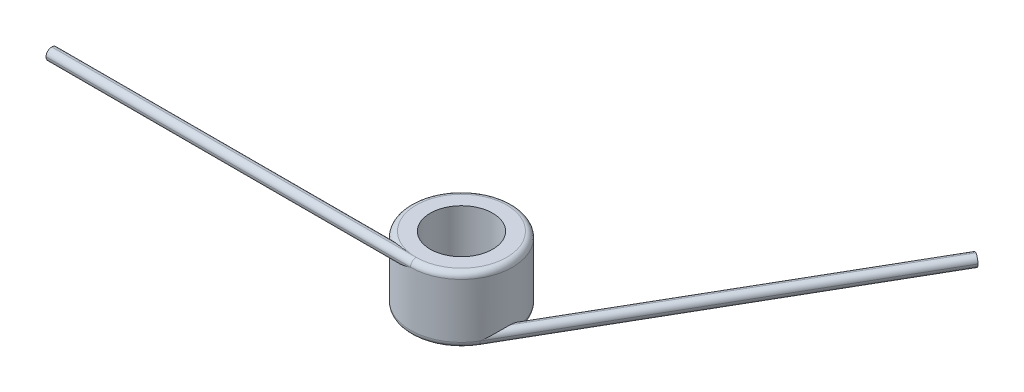
ISO-10303-21;
HEADER;
FILE_DESCRIPTION(('STEP AP214'),'2;1');
FILE_NAME('part.step','',(''),(''),'','','');
FILE_SCHEMA(('AUTOMOTIVE_DESIGN { 1 0 10303 214 1 1 1 1 }'));
ENDSEC;
DATA;
#1=APPLICATION_CONTEXT('core data for automotive mechanical design processes');
#2=APPLICATION_PROTOCOL_DEFINITION('international standard','automotive_design',2000,#1);
#3=PRODUCT_CONTEXT('',#1,'mechanical');
#4=PRODUCT('Part','Part','',(#3));
#5=PRODUCT_RELATED_PRODUCT_CATEGORY('part','',(#4));
#6=PRODUCT_DEFINITION_FORMATION('','',#4);
#7=PRODUCT_DEFINITION_CONTEXT('part definition',#1,'design');
#8=PRODUCT_DEFINITION('design','',#6,#7);
#9=PRODUCT_DEFINITION_SHAPE('','',#8);
#10=(LENGTH_UNIT() NAMED_UNIT(*) SI_UNIT(.MILLI.,.METRE.));
#11=(NAMED_UNIT(*) PLANE_ANGLE_UNIT() SI_UNIT($,.RADIAN.));
#12=(NAMED_UNIT(*) SI_UNIT($,.STERADIAN.) SOLID_ANGLE_UNIT());
#13=UNCERTAINTY_MEASURE_WITH_UNIT(LENGTH_MEASURE(1.E-05),#10,'distance_accuracy_value','');
#14=(GEOMETRIC_REPRESENTATION_CONTEXT(3) GLOBAL_UNCERTAINTY_ASSIGNED_CONTEXT((#13)) GLOBAL_UNIT_ASSIGNED_CONTEXT((#10,
#11,#12)) REPRESENTATION_CONTEXT('',''));
#15=CARTESIAN_POINT('',(0.,0.,0.));
#16=DIRECTION('',(0.,0.,1.));
#17=DIRECTION('',(1.,0.,0.));
#18=AXIS2_PLACEMENT_3D('',#15,#16,#17);
#19=CARTESIAN_POINT('',(0.,9.1948,0.));
#20=DIRECTION('',(0.,-1.,0.));
#21=DIRECTION('',(0.,0.,-1.));
#22=AXIS2_PLACEMENT_3D('',#19,#20,#21);
#23=CYLINDRICAL_SURFACE('',#22,7.112);
#24=CARTESIAN_POINT('',(-3.27726446750945,7.5946,6.3119));
#25=CARTESIAN_POINT('',(-3.22577319071094,7.59460874121384,6.33863640810558));
#26=CARTESIAN_POINT('',(-3.17397080121037,7.59593894352443,6.3647320916057));
#27=CARTESIAN_POINT('',(-3.06985554330409,7.60093516358517,6.41559687844702));
#28=CARTESIAN_POINT('',(-3.01754290426367,7.60460017550516,6.44036654805308));
#29=CARTESIAN_POINT('',(-2.86016865994779,7.61861872182236,6.51254780297371));
#30=CARTESIAN_POINT('',(-2.75444607475934,7.63199848772709,6.55794815943722));
#31=CARTESIAN_POINT('',(-2.54227229890444,7.66493502375927,6.64307265846747));
#32=CARTESIAN_POINT('',(-2.43582617169205,7.6844650790488,6.68282029059783));
#33=CARTESIAN_POINT('',(-2.22200236123469,7.72839217607958,6.7569270793068));
#34=CARTESIAN_POINT('',(-2.11462408422714,7.75279257703432,6.79128248733932));
#35=CARTESIAN_POINT('',(-1.84276867346074,7.81917071884919,6.87124565452523));
#36=CARTESIAN_POINT('',(-1.67785384252937,7.86365942235866,6.9133170976154));
#37=CARTESIAN_POINT('',(-1.34713711270919,7.9585399994525,6.98530174523664));
#38=CARTESIAN_POINT('',(-1.18133498224518,8.00893349380589,7.0152116014921));
#39=CARTESIAN_POINT('',(-0.682899888290272,8.1656694348529,7.08709086236258));
#40=CARTESIAN_POINT('',(-0.349157968962766,8.27758917674851,7.11123322508794));
#41=CARTESIAN_POINT('',(-0.0106605278621279,8.39112437230441,7.11199400277877));
#42=CARTESIAN_POINT('',(-0.00533018613452246,8.39291222380704,7.1119999947834));
#43=CARTESIAN_POINT('',(0.,8.3947,7.112));
#44=B_SPLINE_CURVE_WITH_KNOTS('',3,(#24,#25,#26,#27,#28,#29,#30,#31,#32,#33,#34,#35,#36,#37,#38,
#39,#40,#41,#42,#43),.UNSPECIFIED.,.F.,.F.,(4,2,2,2,2,2,2,2,2,4),(0.,0.174006957486812,
0.347939003854595,0.695046557647343,1.04066671662636,1.38652608839392,1.91360707300454,
2.4408330731805,3.49502816093425,3.51189470542901),.UNSPECIFIED.);
#45=CARTESIAN_POINT('',(0.,8.3947,7.112));
#46=VERTEX_POINT('',#45);
#47=CARTESIAN_POINT('',(-3.27726446750945,7.5946,6.3119));
#48=VERTEX_POINT('',#47);
#49=EDGE_CURVE('E194',#46,#48,#44,.F.);
#50=ORIENTED_EDGE('',*,*,#49,.T.);
#51=CARTESIAN_POINT('',(-3.27726446750944,7.5946,6.3119));
#52=CARTESIAN_POINT('',(-3.33684636501458,7.59462950665445,6.28097233450951));
#53=CARTESIAN_POINT('',(-3.39603078899823,7.59639786892391,6.24916342132021));
#54=CARTESIAN_POINT('',(-3.51355143645542,7.60421608549922,6.1838510683771));
#55=CARTESIAN_POINT('',(-3.57188188450809,7.61028746507999,6.15033989895407));
#56=CARTESIAN_POINT('',(-3.68766233258712,7.62762527577035,6.08163436560927));
#57=CARTESIAN_POINT('',(-3.74509577354935,7.63894768670843,6.04642562220361));
#58=CARTESIAN_POINT('',(-3.85771272353521,7.66787824241751,5.9751998519368));
#59=CARTESIAN_POINT('',(-3.91290116558248,7.68547167202177,5.93918490073875));
#60=CARTESIAN_POINT('',(-4.00525249208175,7.72235362104469,5.87713169880061));
#61=CARTESIAN_POINT('',(-4.04315445374767,7.73980501922617,5.8511087348269));
#62=CARTESIAN_POINT('',(-4.11678717653781,7.77931573574368,5.79953625179383));
#63=CARTESIAN_POINT('',(-4.15252050554959,7.80136946138225,5.77398619871112));
#64=CARTESIAN_POINT('',(-4.22138970936993,7.85101548010348,5.72383115259485));
#65=CARTESIAN_POINT('',(-4.25449880463334,7.87865663809345,5.69923695516696));
#66=CARTESIAN_POINT('',(-4.31651957433505,7.94004310018073,5.65240697734943));
#67=CARTESIAN_POINT('',(-4.34543791946912,7.97377850696718,5.63016746439981));
#68=CARTESIAN_POINT('',(-4.38939727605734,8.03639686071476,5.59591490763217));
#69=CARTESIAN_POINT('',(-4.40597974002244,8.06361737683548,5.58285251332363));
#70=CARTESIAN_POINT('',(-4.43551677737668,8.12105110708317,5.55941455104074));
#71=CARTESIAN_POINT('',(-4.44847432845384,8.15126183711166,5.54903677831234));
#72=CARTESIAN_POINT('',(-4.46851837696362,8.20996768551786,5.53290439682252));
#73=CARTESIAN_POINT('',(-4.47615757469814,8.2381538166173,5.52671766818688));
#74=CARTESIAN_POINT('',(-4.48762439734803,8.29574649734046,5.51741148642021));
#75=CARTESIAN_POINT('',(-4.49146083255316,8.32515006082171,5.51428494362298));
#76=CARTESIAN_POINT('',(-4.4941023454781,8.36803319163165,5.51213071648264));
#77=CARTESIAN_POINT('',(-4.49451449298493,8.38136938047673,5.51179415880985));
#78=CARTESIAN_POINT('',(-4.49450828901227,8.3947,5.5118));
#79=B_SPLINE_CURVE_WITH_KNOTS('',3,(#51,#52,#53,#54,#55,#56,#57,#58,#59,#60,#61,#62,#63,#64,#65,
#66,#67,#68,#69,#70,#71,#72,#73,#74,#75,#76,#77,#78),.UNSPECIFIED.,.F.,.F.,(4,2,2,2,2,2,2,2,2,2,
2,2,2,4),(0.,0.20144452556642,0.403903928729936,0.608573143021147,0.81276522170529,
0.960081764455189,1.10722032145835,1.25570615356907,1.40395297175356,1.50694498887674,
1.60985215301296,1.69902772272233,1.78799620300548,1.82799412834761),.UNSPECIFIED.);
#80=CARTESIAN_POINT('',(-4.49450828901227,8.3947,5.5118));
#81=VERTEX_POINT('',#80);
#82=EDGE_CURVE('E202',#48,#81,#79,.T.);
#83=ORIENTED_EDGE('',*,*,#82,.T.);
#84=CARTESIAN_POINT('',(0.,8.3947,0.));
#85=DIRECTION('',(0.,1.,0.));
#86=DIRECTION('',(0.,0.,1.));
#87=AXIS2_PLACEMENT_3D('',#84,#85,#86);
#88=CIRCLE('',#87,7.112);
#89=EDGE_CURVE('E248',#81,#46,#88,.F.);
#90=ORIENTED_EDGE('',*,*,#89,.T.);
#91=EDGE_LOOP('',(#50,#83,#90));
#92=FACE_BOUND('',#91,.T.);
#93=CARTESIAN_POINT('',(0.,0.8001,0.));
#94=DIRECTION('',(0.,1.,0.));
#95=DIRECTION('',(0.,0.,1.));
#96=AXIS2_PLACEMENT_3D('',#93,#94,#95);
#97=CIRCLE('',#96,7.112);
#98=CARTESIAN_POINT('',(7.0206129650852,0.8001,-1.13645835580435));
#99=VERTEX_POINT('',#98);
#100=CARTESIAN_POINT('',(6.15917267171494,0.8001,3.55599999999999));
#101=VERTEX_POINT('',#100);
#102=EDGE_CURVE('E247',#99,#101,#97,.T.);
#103=ORIENTED_EDGE('',*,*,#102,.T.);
#104=CARTESIAN_POINT('',(7.10489797990172,1.6002,0.317755716216726));
#105=CARTESIAN_POINT('',(7.10230675012785,1.60019125878616,0.375716674050284));
#106=CARTESIAN_POINT('',(7.09900508021779,1.59886105647557,0.433626701084529));
#107=CARTESIAN_POINT('',(7.09099764882732,1.59386483641483,0.54922555277352));
#108=CARTESIAN_POINT('',(7.08629249242931,1.59019982449485,0.606914461924518));
#109=CARTESIAN_POINT('',(7.0701161707097,1.57618127817767,0.779295182863658));
#110=CARTESIAN_POINT('',(7.05657274015375,1.56280151227295,0.893553805622314));
#111=CARTESIAN_POINT('',(7.02420583087093,1.52986497624079,1.11986393504467));
#112=CARTESIAN_POINT('',(7.0054052264299,1.51033492095126,1.23192280141033));
#113=CARTESIAN_POINT('',(6.96267168281605,1.46640782392045,1.45415304755502));
#114=CARTESIAN_POINT('',(6.93873520042581,1.44200742296568,1.56432306727448));
#115=CARTESIAN_POINT('',(6.87205762919264,1.37562928115084,1.83973834274748));
#116=CARTESIAN_POINT('',(6.8260351522169,1.33114057764146,2.00359449733998));
#117=CARTESIAN_POINT('',(6.7230173208293,1.23626000054736,2.32599591063136));
#118=CARTESIAN_POINT('',(6.66601895093812,1.1858665061936,2.48453969574243));
#119=CARTESIAN_POINT('',(6.4790506698795,1.02913056514805,2.95213677968071));
#120=CARTESIAN_POINT('',(6.33308760964255,0.917210823256804,3.25323694149));
#121=CARTESIAN_POINT('',(6.16449774190003,0.803675627695759,3.54676471344307));
#122=CARTESIAN_POINT('',(6.16183776026448,0.801887776193045,3.55138392079232));
#123=CARTESIAN_POINT('',(6.15917267171494,0.8001,3.55599999999999));
#124=B_SPLINE_CURVE_WITH_KNOTS('',3,(#104,#105,#106,#107,#108,#109,#110,#111,#112,#113,#114,
#115,#116,#117,#118,#119,#120,#121,#122,#123),.UNSPECIFIED.,.F.,.F.,(4,2,2,2,2,2,2,2,2,4),(0.,
0.174006957486689,0.347939003854349,0.695046557646906,1.04066671662616,1.38652608839393,
1.91360707300458,2.44083307318063,3.49502816093425,3.51189470542901),.UNSPECIFIED.);
#125=CARTESIAN_POINT('',(7.10489797990172,1.6002,0.317755716216754));
#126=VERTEX_POINT('',#125);
#127=EDGE_CURVE('E11',#101,#126,#124,.F.);
#128=ORIENTED_EDGE('',*,*,#127,.T.);
#129=CARTESIAN_POINT('',(7.10489797990172,1.6002,0.317755716216754));
#130=CARTESIAN_POINT('',(7.10790478465977,1.60017049334555,0.250692446626381));
#131=CARTESIAN_POINT('',(7.10994966976289,1.59840213107609,0.183532775353541));
#132=CARTESIAN_POINT('',(7.11214783666182,1.59058391450078,0.0491007327148604));
#133=CARTESIAN_POINT('',(7.11229153665729,1.58451253492001,-0.0181705018243961));
#134=CARTESIAN_POINT('',(7.11068102343965,1.56717472422965,-0.152792077794776));
#135=CARTESIAN_POINT('',(7.10890607769613,1.55585231329157,-0.220135268397657));
#136=CARTESIAN_POINT('',(7.1035312262339,1.52692175758249,-0.353277293115536));
#137=CARTESIAN_POINT('',(7.09993558460395,1.50932832797823,-0.419079361522783));
#138=CARTESIAN_POINT('',(7.09237159858899,1.47244637895531,-0.530084557313414));
#139=CARTESIAN_POINT('',(7.08878603153896,1.45499498077383,-0.575920100956219));
#140=CARTESIAN_POINT('',(7.08093931249115,1.41548426425633,-0.665474150958833));
#141=CARTESIAN_POINT('',(7.07667898195937,1.39343053861776,-0.709195148186177));
#142=CARTESIAN_POINT('',(7.06767803980487,1.34378451989653,-0.793915151291135));
#143=CARTESIAN_POINT('',(7.06293338767833,1.31614336190656,-0.834885567599511));
#144=CARTESIAN_POINT('',(7.05338782208054,1.25475689981928,-0.912012118632224));
#145=CARTESIAN_POINT('',(7.04858701146541,1.22102149303283,-0.948175896628547));
#146=CARTESIAN_POINT('',(7.04090310545418,1.15840313928525,-1.00337209455178));
#147=CARTESIAN_POINT('',(7.03788197213129,1.13118262316452,-1.02426412675717));
#148=CARTESIAN_POINT('',(7.03235262005848,1.07374889291683,-1.06156293259992));
#149=CARTESIAN_POINT('',(7.02984398077957,1.04353816288834,-1.07797338736777));
#150=CARTESIAN_POINT('',(7.02589495284072,0.984832314482139,-1.10339823331684));
#151=CARTESIAN_POINT('',(7.0243566875432,0.956646183382703,-1.11310733693729));
#152=CARTESIAN_POINT('',(7.02203070904598,0.89905350265954,-1.12769098753611));
#153=CARTESIAN_POINT('',(7.02124126116012,0.869649939178285,-1.13257670928235));
#154=CARTESIAN_POINT('',(7.02069640219354,0.826766808368349,-1.13594144014994));
#155=CARTESIAN_POINT('',(7.02061100845247,0.813430619523269,-1.13646664919736));
#156=CARTESIAN_POINT('',(7.02061296508521,0.8001,-1.13645835580435));
#157=B_SPLINE_CURVE_WITH_KNOTS('',3,(#129,#130,#131,#132,#133,#134,#135,#136,#137,#138,#139,
#140,#141,#142,#143,#144,#145,#146,#147,#148,#149,#150,#151,#152,#153,#154,#155,#156),
.UNSPECIFIED.,.F.,.F.,(4,2,2,2,2,2,2,2,2,2,2,2,2,4),(0.,0.20144452556642,0.403903928729936,
0.608573143021147,0.81276522170529,0.960081764455191,1.10722032145835,1.25570615356907,
1.40395297175357,1.50694498887675,1.60985215301298,1.69902772272234,1.78799620300549,
1.82799412834762),.UNSPECIFIED.);
#158=EDGE_CURVE('E44',#126,#99,#157,.T.);
#159=ORIENTED_EDGE('',*,*,#158,.T.);
#160=EDGE_LOOP('',(#103,#128,#159));
#161=FACE_BOUND('',#160,.T.);
#162=ADVANCED_FACE('F34',(#92,#161),#23,.T.);
#163=CARTESIAN_POINT('',(0.,9.1948,0.));
#164=DIRECTION('',(0.,1.,0.));
#165=DIRECTION('',(0.,0.,1.));
#166=AXIS2_PLACEMENT_3D('',#163,#164,#165);
#167=PLANE('',#166);
#168=CARTESIAN_POINT('',(0.,9.1948,0.));
#169=DIRECTION('',(0.,1.,0.));
#170=DIRECTION('',(0.,0.,1.));
#171=AXIS2_PLACEMENT_3D('',#168,#169,#170);
#172=CIRCLE('',#171,6.3119);
#173=CARTESIAN_POINT('',(0.,9.1948,6.3119));
#174=VERTEX_POINT('',#173);
#175=EDGE_CURVE('E233',#174,#174,#172,.T.);
#176=ORIENTED_EDGE('',*,*,#175,.T.);
#177=EDGE_LOOP('',(#176));
#178=FACE_BOUND('',#177,.T.);
#179=CARTESIAN_POINT('',(0.,9.1948,0.));
#180=DIRECTION('',(0.,1.,0.));
#181=DIRECTION('',(0.,0.,1.));
#182=AXIS2_PLACEMENT_3D('',#179,#180,#181);
#183=CIRCLE('',#182,4.3561);
#184=CARTESIAN_POINT('',(0.,9.1948,4.3561));
#185=VERTEX_POINT('',#184);
#186=EDGE_CURVE('E270',#185,#185,#183,.T.);
#187=ORIENTED_EDGE('',*,*,#186,.F.);
#188=EDGE_LOOP('',(#187));
#189=FACE_BOUND('',#188,.T.);
#190=ADVANCED_FACE('F186',(#178,#189),#167,.T.);
#191=CARTESIAN_POINT('',(0.,0.,0.));
#192=DIRECTION('',(0.,1.,0.));
#193=DIRECTION('',(0.,0.,1.));
#194=AXIS2_PLACEMENT_3D('',#191,#192,#193);
#195=PLANE('',#194);
#196=CARTESIAN_POINT('',(0.,0.,0.));
#197=DIRECTION('',(0.,1.,0.));
#198=DIRECTION('',(0.,0.,1.));
#199=AXIS2_PLACEMENT_3D('',#196,#197,#198);
#200=CIRCLE('',#199,6.3119);
#201=CARTESIAN_POINT('',(5.466265746147,0.,3.15594999999999));
#202=VERTEX_POINT('',#201);
#203=EDGE_CURVE('E278',#202,#202,#200,.F.);
#204=ORIENTED_EDGE('',*,*,#203,.T.);
#205=EDGE_LOOP('',(#204));
#206=FACE_BOUND('',#205,.T.);
#207=CARTESIAN_POINT('',(0.,0.,0.));
#208=DIRECTION('',(0.,1.,0.));
#209=DIRECTION('',(0.,0.,1.));
#210=AXIS2_PLACEMENT_3D('',#207,#208,#209);
#211=CIRCLE('',#210,4.3561);
#212=CARTESIAN_POINT('',(0.,0.,4.3561));
#213=VERTEX_POINT('',#212);
#214=EDGE_CURVE('E271',#213,#213,#211,.T.);
#215=ORIENTED_EDGE('',*,*,#214,.T.);
#216=EDGE_LOOP('',(#215));
#217=FACE_BOUND('',#216,.T.);
#218=ADVANCED_FACE('F188',(#206,#217),#195,.F.);
#219=CARTESIAN_POINT('',(0.,9.1948,0.));
#220=DIRECTION('',(0.,-1.,0.));
#221=DIRECTION('',(0.,0.,-1.));
#222=AXIS2_PLACEMENT_3D('',#219,#220,#221);
#223=CYLINDRICAL_SURFACE('',#222,4.3561);
#224=ORIENTED_EDGE('',*,*,#186,.T.);
#225=EDGE_LOOP('',(#224));
#226=FACE_BOUND('',#225,.T.);
#227=ORIENTED_EDGE('',*,*,#214,.F.);
#228=EDGE_LOOP('',(#227));
#229=FACE_BOUND('',#228,.T.);
#230=ADVANCED_FACE('F255',(#226,#229),#223,.F.);
#231=CARTESIAN_POINT('',(-50.8,7.5946,7.11200000000001));
#232=DIRECTION('',(-1.,0.,0.));
#233=DIRECTION('',(0.,0.,1.));
#234=AXIS2_PLACEMENT_3D('',#231,#232,#233);
#235=PLANE('',#234);
#236=CARTESIAN_POINT('',(-50.8,8.3947,6.31190000000001));
#237=DIRECTION('',(-1.,0.,0.));
#238=DIRECTION('',(0.,0.,1.));
#239=AXIS2_PLACEMENT_3D('',#236,#237,#238);
#240=CIRCLE('',#239,0.8001);
#241=CARTESIAN_POINT('',(-50.8,7.5946,6.31190000000001));
#242=VERTEX_POINT('',#241);
#243=CARTESIAN_POINT('',(-50.8,8.3947,7.11200000000001));
#244=VERTEX_POINT('',#243);
#245=EDGE_CURVE('E123',#242,#244,#240,.T.);
#246=ORIENTED_EDGE('',*,*,#245,.T.);
#247=CARTESIAN_POINT('',(-50.8,8.3947,6.31190000000001));
#248=DIRECTION('',(-1.,0.,0.));
#249=DIRECTION('',(0.,0.,1.));
#250=AXIS2_PLACEMENT_3D('',#247,#248,#249);
#251=CIRCLE('',#250,0.8001);
#252=CARTESIAN_POINT('',(-50.8,9.1948,6.31190000000001));
#253=VERTEX_POINT('',#252);
#254=EDGE_CURVE('E108',#244,#253,#251,.T.);
#255=ORIENTED_EDGE('',*,*,#254,.T.);
#256=CARTESIAN_POINT('',(-50.8,8.3947,6.31190000000001));
#257=DIRECTION('',(-1.,0.,0.));
#258=DIRECTION('',(0.,0.,1.));
#259=AXIS2_PLACEMENT_3D('',#256,#257,#258);
#260=CIRCLE('',#259,0.8001);
#261=CARTESIAN_POINT('',(-50.8,8.3947,5.51180000000001));
#262=VERTEX_POINT('',#261);
#263=EDGE_CURVE('E117',#253,#262,#260,.T.);
#264=ORIENTED_EDGE('',*,*,#263,.T.);
#265=CARTESIAN_POINT('',(-50.8,8.3947,6.31190000000001));
#266=DIRECTION('',(-1.,0.,0.));
#267=DIRECTION('',(0.,0.,1.));
#268=AXIS2_PLACEMENT_3D('',#265,#266,#267);
#269=CIRCLE('',#268,0.8001);
#270=EDGE_CURVE('E124',#262,#242,#269,.T.);
#271=ORIENTED_EDGE('',*,*,#270,.T.);
#272=EDGE_LOOP('',(#246,#255,#264,#271));
#273=FACE_BOUND('',#272,.T.);
#274=ADVANCED_FACE('F126',(#273),#235,.T.);
#275=CARTESIAN_POINT('',(31.5591726717149,1.6002,-40.4380905122495));
#276=DIRECTION('',(0.499999999999999,0.,-0.866025403784439));
#277=DIRECTION('',(-0.866025403784439,0.,-0.499999999999999));
#278=AXIS2_PLACEMENT_3D('',#275,#276,#277);
#279=PLANE('',#278);
#280=CARTESIAN_POINT('',(30.8662657461469,0.8001,-40.8381405122495));
#281=DIRECTION('',(0.499999999999999,0.,-0.866025403784439));
#282=DIRECTION('',(-0.866025403784439,0.,-0.499999999999999));
#283=AXIS2_PLACEMENT_3D('',#280,#281,#282);
#284=CIRCLE('',#283,0.8001);
#285=CARTESIAN_POINT('',(30.173358820579,0.8001,-41.2381905122495));
#286=VERTEX_POINT('',#285);
#287=CARTESIAN_POINT('',(30.8662657461469,1.6002,-40.8381405122495));
#288=VERTEX_POINT('',#287);
#289=EDGE_CURVE('E130',#286,#288,#284,.T.);
#290=ORIENTED_EDGE('',*,*,#289,.T.);
#291=CARTESIAN_POINT('',(30.8662657461469,0.8001,-40.8381405122495));
#292=DIRECTION('',(0.499999999999999,0.,-0.866025403784439));
#293=DIRECTION('',(-0.866025403784439,0.,-0.499999999999999));
#294=AXIS2_PLACEMENT_3D('',#291,#292,#293);
#295=CIRCLE('',#294,0.8001);
#296=CARTESIAN_POINT('',(31.5591726717149,0.8001,-40.4380905122495));
#297=VERTEX_POINT('',#296);
#298=EDGE_CURVE('E231',#288,#297,#295,.T.);
#299=ORIENTED_EDGE('',*,*,#298,.T.);
#300=CARTESIAN_POINT('',(30.8662657461469,0.8001,-40.8381405122495));
#301=DIRECTION('',(0.499999999999999,0.,-0.866025403784439));
#302=DIRECTION('',(-0.866025403784439,0.,-0.499999999999999));
#303=AXIS2_PLACEMENT_3D('',#300,#301,#302);
#304=CIRCLE('',#303,0.8001);
#305=CARTESIAN_POINT('',(30.8662657461469,0.,-40.8381405122495));
#306=VERTEX_POINT('',#305);
#307=EDGE_CURVE('E225',#297,#306,#304,.T.);
#308=ORIENTED_EDGE('',*,*,#307,.T.);
#309=CARTESIAN_POINT('',(30.8662657461469,0.8001,-40.8381405122495));
#310=DIRECTION('',(0.499999999999999,0.,-0.866025403784439));
#311=DIRECTION('',(-0.866025403784439,0.,-0.499999999999999));
#312=AXIS2_PLACEMENT_3D('',#309,#310,#311);
#313=CIRCLE('',#312,0.8001);
#314=EDGE_CURVE('E128',#306,#286,#313,.T.);
#315=ORIENTED_EDGE('',*,*,#314,.T.);
#316=EDGE_LOOP('',(#290,#299,#308,#315));
#317=FACE_BOUND('',#316,.T.);
#318=ADVANCED_FACE('F212',(#317),#279,.T.);
#319=CARTESIAN_POINT('',(-50.8,8.3947,6.31190000000001));
#320=DIRECTION('',(1.,0.,0.));
#321=DIRECTION('',(0.,0.,-1.));
#322=AXIS2_PLACEMENT_3D('',#319,#320,#321);
#323=CYLINDRICAL_SURFACE('',#322,0.8001);
#324=DIRECTION('',(-1.,0.,0.));
#325=VECTOR('',#324,1.);
#326=CARTESIAN_POINT('',(-50.8,8.3947,5.51180000000001));
#327=LINE('',#326,#325);
#328=EDGE_CURVE('E120',#81,#262,#327,.T.);
#329=ORIENTED_EDGE('',*,*,#328,.F.);
#330=ORIENTED_EDGE('',*,*,#82,.F.);
#331=DIRECTION('',(-1.,0.,0.));
#332=VECTOR('',#331,1.);
#333=CARTESIAN_POINT('',(-4.49450828901227,7.5946,6.3119));
#334=LINE('',#333,#332);
#335=EDGE_CURVE('E58',#242,#48,#334,.F.);
#336=ORIENTED_EDGE('',*,*,#335,.F.);
#337=ORIENTED_EDGE('',*,*,#270,.F.);
#338=EDGE_LOOP('',(#329,#330,#336,#337));
#339=FACE_BOUND('',#338,.T.);
#340=ADVANCED_FACE('F208',(#339),#323,.T.);
#341=CARTESIAN_POINT('',(0.,8.3947,6.3119));
#342=DIRECTION('',(-1.,0.,0.));
#343=DIRECTION('',(0.,0.,1.));
#344=AXIS2_PLACEMENT_3D('',#341,#342,#343);
#345=CYLINDRICAL_SURFACE('',#344,0.8001);
#346=ORIENTED_EDGE('',*,*,#335,.T.);
#347=ORIENTED_EDGE('',*,*,#49,.F.);
#348=DIRECTION('',(1.,0.,0.));
#349=VECTOR('',#348,1.);
#350=CARTESIAN_POINT('',(0.,8.3947,7.112));
#351=LINE('',#350,#349);
#352=EDGE_CURVE('E114',#244,#46,#351,.T.);
#353=ORIENTED_EDGE('',*,*,#352,.F.);
#354=ORIENTED_EDGE('',*,*,#245,.F.);
#355=EDGE_LOOP('',(#346,#347,#353,#354));
#356=FACE_BOUND('',#355,.T.);
#357=ADVANCED_FACE('F211',(#356),#345,.T.);
#358=CARTESIAN_POINT('',(0.,8.3947,6.3119));
#359=DIRECTION('',(-1.,0.,0.));
#360=DIRECTION('',(0.,0.,1.));
#361=AXIS2_PLACEMENT_3D('',#358,#359,#360);
#362=CYLINDRICAL_SURFACE('',#361,0.8001);
#363=DIRECTION('',(-1.,0.,0.));
#364=VECTOR('',#363,1.);
#365=CARTESIAN_POINT('',(0.,9.1948,6.3119));
#366=LINE('',#365,#364);
#367=EDGE_CURVE('E103',#174,#253,#366,.T.);
#368=ORIENTED_EDGE('',*,*,#367,.F.);
#369=CARTESIAN_POINT('',(-4.49450828901227,8.3947,5.5118));
#370=CARTESIAN_POINT('',(-4.49455617125827,8.4118862482946,5.51178205985278));
#371=CARTESIAN_POINT('',(-4.49295546886804,8.42900224500844,5.51235290495125));
#372=CARTESIAN_POINT('',(-4.4869095043412,8.46243770815079,5.5145037205712));
#373=CARTESIAN_POINT('',(-4.48250162244098,8.47876465272092,5.5160704297111));
#374=CARTESIAN_POINT('',(-4.46994458140216,8.51418490436928,5.52052340997563));
#375=CARTESIAN_POINT('',(-4.46115685700188,8.53301836693115,5.52363423130617));
#376=CARTESIAN_POINT('',(-4.44082746366797,8.56901271185598,5.53080224838428));
#377=CARTESIAN_POINT('',(-4.42927116766587,8.58616400462272,5.53486446796762));
#378=CARTESIAN_POINT('',(-4.39596286024187,8.62951572149106,5.54651778565137));
#379=CARTESIAN_POINT('',(-4.37250778346476,8.65423850049367,5.55467127346607));
#380=CARTESIAN_POINT('',(-4.32251720873424,8.69988342726998,5.57188820500327));
#381=CARTESIAN_POINT('',(-4.2959754584082,8.72079763266959,5.58095349046724));
#382=CARTESIAN_POINT('',(-4.23213756325965,8.76588411968306,5.6025385982866));
#383=CARTESIAN_POINT('',(-4.19412538037041,8.78894522742974,5.61523276652445));
#384=CARTESIAN_POINT('',(-4.1160868530055,8.83122592446432,5.64091986641841));
#385=CARTESIAN_POINT('',(-4.0760567513697,8.85043798968117,5.65391332893049));
#386=CARTESIAN_POINT('',(-3.99451052267213,8.88594819231358,5.67998077733219));
#387=CARTESIAN_POINT('',(-3.95298803989149,8.90223148989094,5.69305484428637));
#388=CARTESIAN_POINT('',(-3.86908091856365,8.9323652216081,5.71905052389985));
#389=CARTESIAN_POINT('',(-3.82669705486047,8.94621774286996,5.73197225837321));
#390=CARTESIAN_POINT('',(-3.72247799910397,8.9776120448812,5.76321169812549));
#391=CARTESIAN_POINT('',(-3.66028774558067,8.99409620111446,5.78140265005753));
#392=CARTESIAN_POINT('',(-3.53495553032643,9.02390006976787,5.81712116982577));
#393=CARTESIAN_POINT('',(-3.47181318338933,9.03721846272208,5.83464845850244));
#394=CARTESIAN_POINT('',(-3.34474600951709,9.06133371691254,5.86895557787672));
#395=CARTESIAN_POINT('',(-3.28082013355971,9.07212669060322,5.88573422442642));
#396=CARTESIAN_POINT('',(-3.15243439301656,9.09163379058246,5.91844799410615));
#397=CARTESIAN_POINT('',(-3.08797445815252,9.10034763862862,5.93438300411336));
#398=CARTESIAN_POINT('',(-2.89400306605376,9.12392647159121,5.98083697727947));
#399=CARTESIAN_POINT('',(-2.76385785466425,9.13623619141538,6.01001629671084));
#400=CARTESIAN_POINT('',(-2.50254989083511,9.15614493519513,6.06452257658451));
#401=CARTESIAN_POINT('',(-2.37138804860275,9.16374776907002,6.08985264018478));
#402=CARTESIAN_POINT('',(-2.08959512801919,9.17656787759887,6.13984999712729));
#403=CARTESIAN_POINT('',(-1.93883566611934,9.18129527771964,6.1639161847058));
#404=CARTESIAN_POINT('',(-1.63669326056512,9.18814890114892,6.2067031747915));
#405=CARTESIAN_POINT('',(-1.48531128369578,9.19027824303885,6.2254303652246));
#406=CARTESIAN_POINT('',(-1.23997463109164,9.19256619409904,6.25134927046494));
#407=CARTESIAN_POINT('',(-1.1461970501965,9.19316704267454,6.26021364301891));
#408=CARTESIAN_POINT('',(-0.95845000311253,9.19402671549978,6.27586437252797));
#409=CARTESIAN_POINT('',(-0.864480506008574,9.19428547943085,6.28265036284661));
#410=CARTESIAN_POINT('',(-0.657661711663815,9.19465722187888,6.29527268761071));
#411=CARTESIAN_POINT('',(-0.54478388447378,9.19473084436402,6.30064987848576));
#412=CARTESIAN_POINT('',(-0.366493509773655,9.19478619060907,6.30674924511445));
#413=CARTESIAN_POINT('',(-0.301113729751106,9.19479356050658,6.30847814763422));
#414=CARTESIAN_POINT('',(-0.194604669897312,9.19479911901832,6.31046698291288));
#415=CARTESIAN_POINT('',(-0.153481064820666,9.19479970005013,6.31103396370075));
#416=CARTESIAN_POINT('',(-0.0749051129958276,9.19479997464668,6.31173332868873));
#417=CARTESIAN_POINT('',(-0.0374530692092742,9.19479974287284,6.31190001971099));
#418=CARTESIAN_POINT('',(-1.01697557154326E-06,9.1948,6.31190000000051));
#419=B_SPLINE_CURVE_WITH_KNOTS('',3,(#369,#370,#371,#372,#373,#374,#375,#376,#377,#378,#379,
#380,#381,#382,#383,#384,#385,#386,#387,#388,#389,#390,#391,#392,#393,#394,#395,#396,#397,#398,
#399,#400,#401,#402,#403,#404,#405,#406,#407,#408,#409,#410,#411,#412,#413,#414,#415,#416,#417,
#418),.UNSPECIFIED.,.F.,.F.,(4,2,2,2,2,2,2,2,2,2,2,2,2,2,2,2,2,2,2,2,2,2,2,2,4),(0.,
0.0513618953576123,0.102053764829858,0.164743323083666,0.22777168829381,0.332301047223074,
0.43704595520198,0.575434527135158,0.714091035399815,0.853431443136329,0.992651618167754,
1.19311311864187,1.39365802400674,1.59450963980573,1.79538811984527,2.19701236905722,
2.59831110295431,3.05640175011424,3.51394198509666,3.79651299536869,4.07913382383031,
4.41810683130702,4.61430760274623,4.73768820448015,4.85004398526194),.UNSPECIFIED.);
#420=EDGE_CURVE('E283',#81,#174,#419,.T.);
#421=ORIENTED_EDGE('',*,*,#420,.F.);
#422=ORIENTED_EDGE('',*,*,#328,.T.);
#423=ORIENTED_EDGE('',*,*,#263,.F.);
#424=EDGE_LOOP('',(#368,#421,#422,#423));
#425=FACE_BOUND('',#424,.T.);
#426=ADVANCED_FACE('F118',(#425),#362,.T.);
#427=CARTESIAN_POINT('',(0.,8.3947,0.));
#428=DIRECTION('',(0.,1.,0.));
#429=DIRECTION('',(0.,0.,1.));
#430=AXIS2_PLACEMENT_3D('',#427,#428,#429);
#431=TOROIDAL_SURFACE('',#430,6.3119,0.8001);
#432=ORIENTED_EDGE('',*,*,#420,.T.);
#433=ORIENTED_EDGE('',*,*,#175,.F.);
#434=CARTESIAN_POINT('',(0.,8.3947,6.3119));
#435=DIRECTION('',(-1.,0.,0.));
#436=DIRECTION('',(0.,-1.,0.));
#437=AXIS2_PLACEMENT_3D('',#434,#435,#436);
#438=CIRCLE('',#437,0.8001);
#439=EDGE_CURVE('E110',#46,#174,#438,.T.);
#440=ORIENTED_EDGE('',*,*,#439,.F.);
#441=ORIENTED_EDGE('',*,*,#89,.F.);
#442=EDGE_LOOP('',(#432,#433,#440,#441));
#443=FACE_BOUND('',#442,.T.);
#444=ADVANCED_FACE('F287',(#443),#431,.T.);
#445=CARTESIAN_POINT('',(0.,8.3947,6.3119));
#446=DIRECTION('',(1.,0.,0.));
#447=DIRECTION('',(0.,0.,-1.));
#448=AXIS2_PLACEMENT_3D('',#445,#446,#447);
#449=CYLINDRICAL_SURFACE('',#448,0.8001);
#450=ORIENTED_EDGE('',*,*,#254,.F.);
#451=ORIENTED_EDGE('',*,*,#352,.T.);
#452=ORIENTED_EDGE('',*,*,#439,.T.);
#453=ORIENTED_EDGE('',*,*,#367,.T.);
#454=EDGE_LOOP('',(#450,#451,#452,#453));
#455=FACE_BOUND('',#454,.T.);
#456=ADVANCED_FACE('F105',(#455),#449,.T.);
#457=CARTESIAN_POINT('',(30.8662657461469,0.8001,-40.8381405122495));
#458=DIRECTION('',(-0.499999999999998,0.,0.86602540378444));
#459=DIRECTION('',(0.86602540378444,0.,0.499999999999998));
#460=AXIS2_PLACEMENT_3D('',#457,#458,#459);
#461=CYLINDRICAL_SURFACE('',#460,0.8001);
#462=DIRECTION('',(0.499999999999998,0.,-0.86602540378444));
#463=VECTOR('',#462,1.);
#464=CARTESIAN_POINT('',(30.173358820579,0.8001,-41.2381905122495));
#465=LINE('',#464,#463);
#466=EDGE_CURVE('E157',#99,#286,#465,.T.);
#467=ORIENTED_EDGE('',*,*,#466,.F.);
#468=ORIENTED_EDGE('',*,*,#158,.F.);
#469=DIRECTION('',(0.499999999999998,0.,-0.86602540378444));
#470=VECTOR('',#469,1.);
#471=CARTESIAN_POINT('',(7.71351989065313,1.6002,-0.736408355804345));
#472=LINE('',#471,#470);
#473=EDGE_CURVE('E237',#288,#126,#472,.F.);
#474=ORIENTED_EDGE('',*,*,#473,.F.);
#475=ORIENTED_EDGE('',*,*,#289,.F.);
#476=EDGE_LOOP('',(#467,#468,#474,#475));
#477=FACE_BOUND('',#476,.T.);
#478=ADVANCED_FACE('F36',(#477),#461,.T.);
#479=CARTESIAN_POINT('',(5.46626574614701,0.8001,3.15594999999999));
#480=DIRECTION('',(0.499999999999998,0.,-0.86602540378444));
#481=DIRECTION('',(-0.86602540378444,0.,-0.499999999999998));
#482=AXIS2_PLACEMENT_3D('',#479,#480,#481);
#483=CYLINDRICAL_SURFACE('',#482,0.8001);
#484=ORIENTED_EDGE('',*,*,#473,.T.);
#485=ORIENTED_EDGE('',*,*,#127,.F.);
#486=DIRECTION('',(-0.499999999999998,0.,0.86602540378444));
#487=VECTOR('',#486,1.);
#488=CARTESIAN_POINT('',(6.15917267171494,0.8001,3.55599999999999));
#489=LINE('',#488,#487);
#490=EDGE_CURVE('E143',#297,#101,#489,.T.);
#491=ORIENTED_EDGE('',*,*,#490,.F.);
#492=ORIENTED_EDGE('',*,*,#298,.F.);
#493=EDGE_LOOP('',(#484,#485,#491,#492));
#494=FACE_BOUND('',#493,.T.);
#495=ADVANCED_FACE('F165',(#494),#483,.T.);
#496=CARTESIAN_POINT('',(5.46626574614701,0.8001,3.15594999999999));
#497=DIRECTION('',(-0.499999999999998,0.,0.86602540378444));
#498=DIRECTION('',(0.86602540378444,0.,0.499999999999998));
#499=AXIS2_PLACEMENT_3D('',#496,#497,#498);
#500=CYLINDRICAL_SURFACE('',#499,0.8001);
#501=DIRECTION('',(0.499999999999998,0.,-0.86602540378444));
#502=VECTOR('',#501,1.);
#503=CARTESIAN_POINT('',(30.8662657461469,0.,-40.8381405122495));
#504=LINE('',#503,#502);
#505=EDGE_CURVE('E141',#202,#306,#504,.T.);
#506=ORIENTED_EDGE('',*,*,#505,.F.);
#507=CARTESIAN_POINT('',(5.46626574614701,0.,3.15594999999999));
#508=CARTESIAN_POINT('',(5.48499194360672,3.01436874044594E-07,3.12351532321998));
#509=CARTESIAN_POINT('',(5.50357377667506,5.09058655384141E-08,3.09099726160915));
#510=CARTESIAN_POINT('',(5.54785580868959,3.03877549587931E-07,3.01269731480044));
#511=CARTESIAN_POINT('',(5.57341603222401,1.15082484329584E-06,2.9668362145369));
#512=CARTESIAN_POINT('',(5.62747615511986,9.80760967247311E-06,2.86840132096886));
#513=CARTESIAN_POINT('',(5.65589075719667,1.85690270419527E-05,2.81578063715089));
#514=CARTESIAN_POINT('',(5.70460647812263,5.56398820349567E-05,2.72401375485921));
#515=CARTESIAN_POINT('',(5.72507861374595,7.82113075638609E-05,2.68495812182872));
#516=CARTESIAN_POINT('',(5.78588008951797,0.000179526392677092,2.56747592735186));
#517=CARTESIAN_POINT('',(5.8255963803519,0.000291869876274688,2.48873061339291));
#518=CARTESIAN_POINT('',(5.90340362598472,0.000710505163609504,2.33038475923726));
#519=CARTESIAN_POINT('',(5.94149357513656,0.00101691516612217,2.25078372691964));
#520=CARTESIAN_POINT('',(6.05375478533984,0.00243167822124585,2.00979109788142));
#521=CARTESIAN_POINT('',(6.12539815274884,0.00403793380770167,1.84721340193657));
#522=CARTESIAN_POINT('',(6.26194131545692,0.0101787034895608,1.51922431480576));
#523=CARTESIAN_POINT('',(6.32683813664661,0.0147145027267361,1.35381171100952));
#524=CARTESIAN_POINT('',(6.44971816648856,0.0290262713147714,1.02097560636094));
#525=CARTESIAN_POINT('',(6.50771447096365,0.038792114751575,0.853556600412991));
#526=CARTESIAN_POINT('',(6.58956449724834,0.0599440691756455,0.601372149437115));
#527=CARTESIAN_POINT('',(6.61598266992891,0.0680748812654441,0.51716226234313));
#528=CARTESIAN_POINT('',(6.66709904444968,0.0871214018175803,0.348540895999473));
#529=CARTESIAN_POINT('',(6.69179752063891,0.0980366647652307,0.264129451137619));
#530=CARTESIAN_POINT('',(6.73713677088806,0.122206832317397,0.103545766095077));
#531=CARTESIAN_POINT('',(6.75793859588221,0.135131135360644,0.0273702959414495));
#532=CARTESIAN_POINT('',(6.79811427387611,0.164725675656308,-0.124747840446097));
#533=CARTESIAN_POINT('',(6.81748620802567,0.181400829220426,-0.200690067328777));
#534=CARTESIAN_POINT('',(6.85589282521668,0.220852852196704,-0.356554212188834));
#535=CARTESIAN_POINT('',(6.87482865619278,0.243948977073625,-0.436423988990515));
#536=CARTESIAN_POINT('',(6.90178441616856,0.28442841100597,-0.554467260873944));
#537=CARTESIAN_POINT('',(6.91052010903726,0.298876278272559,-0.593482292944612));
#538=CARTESIAN_POINT('',(6.92747118655218,0.330172129151042,-0.670644810539712));
#539=CARTESIAN_POINT('',(6.93568687778714,0.347018679114234,-0.708792798599849));
#540=CARTESIAN_POINT('',(6.94985877843548,0.37986413626654,-0.775852360136799));
#541=CARTESIAN_POINT('',(6.95592641429639,0.395294190037036,-0.805016969407705));
#542=CARTESIAN_POINT('',(6.9676413283267,0.42849666006968,-0.862158553152275));
#543=CARTESIAN_POINT('',(6.97328792963021,0.446272725976934,-0.890133585479628));
#544=CARTESIAN_POINT('',(6.98408982291689,0.484890086904144,-0.944406373225077));
#545=CARTESIAN_POINT('',(6.98924025191588,0.505757454206991,-0.970686826656529));
#546=CARTESIAN_POINT('',(6.99878511521458,0.551206948298575,-1.02002274267634));
#547=CARTESIAN_POINT('',(7.00318158417864,0.575778729952659,-1.04308685250636));
#548=CARTESIAN_POINT('',(7.00910133885217,0.617238835010894,-1.07445813257487));
#549=CARTESIAN_POINT('',(7.01102482034356,0.632576449384458,-1.08472187319987));
#550=CARTESIAN_POINT('',(7.01442461275767,0.664557889179751,-1.10294666599714));
#551=CARTESIAN_POINT('',(7.01590273512341,0.681196066851614,-1.11091704002567));
#552=CARTESIAN_POINT('',(7.01822332068741,0.714521153916505,-1.12346593494493));
#553=CARTESIAN_POINT('',(7.01910131079203,0.731132309423831,-1.12823366346939));
#554=CARTESIAN_POINT('',(7.02030433554237,0.765165930943622,-1.1347768732414));
#555=CARTESIAN_POINT('',(7.0206220555862,0.7825961220532,-1.13651276967414));
#556=CARTESIAN_POINT('',(7.0206129650852,0.800099999999998,-1.13645835580435));
#557=B_SPLINE_CURVE_WITH_KNOTS('',3,(#507,#508,#509,#510,#511,#512,#513,#514,#515,#516,#517,
#518,#519,#520,#521,#522,#523,#524,#525,#526,#527,#528,#529,#530,#531,#532,#533,#534,#535,#536,
#537,#538,#539,#540,#541,#542,#543,#544,#545,#546,#547,#548,#549,#550,#551,#552,#553,#554,#555,
#556),.UNSPECIFIED.,.F.,.F.,(4,2,2,2,2,2,2,2,2,2,2,2,2,2,2,2,2,2,2,2,2,2,2,2,4),(0.,
0.112356797747284,0.269861770094942,0.449262320702092,0.581548382959104,0.846108701409403,
1.11083030897202,1.64366037407004,2.1767243417079,2.70875995311279,2.97460471902728,
3.24040697618549,3.48036951661817,3.72064843250713,3.9761269116961,4.10360463287721,
4.23100648031485,4.3315737728698,4.43229940192944,4.5339288133469,4.63527949397712,
4.69079513090563,4.74608181813411,4.79771806507705,4.8500235922693),.UNSPECIFIED.);
#558=EDGE_CURVE('E148',#99,#202,#557,.F.);
#559=ORIENTED_EDGE('',*,*,#558,.F.);
#560=ORIENTED_EDGE('',*,*,#466,.T.);
#561=ORIENTED_EDGE('',*,*,#314,.F.);
#562=EDGE_LOOP('',(#506,#559,#560,#561));
#563=FACE_BOUND('',#562,.T.);
#564=ADVANCED_FACE('F162',(#563),#500,.T.);
#565=CARTESIAN_POINT('',(0.,0.8001,0.));
#566=DIRECTION('',(0.,1.,0.));
#567=DIRECTION('',(0.,0.,1.));
#568=AXIS2_PLACEMENT_3D('',#565,#566,#567);
#569=TOROIDAL_SURFACE('',#568,6.3119,0.8001);
#570=ORIENTED_EDGE('',*,*,#558,.T.);
#571=ORIENTED_EDGE('',*,*,#203,.F.);
#572=CARTESIAN_POINT('',(5.466265746147,0.8001,3.15594999999999));
#573=DIRECTION('',(0.499999999999999,0.,-0.86602540378444));
#574=DIRECTION('',(-0.86602540378444,0.,-0.499999999999999));
#575=AXIS2_PLACEMENT_3D('',#572,#573,#574);
#576=CIRCLE('',#575,0.8001);
#577=EDGE_CURVE('E139',#101,#202,#576,.T.);
#578=ORIENTED_EDGE('',*,*,#577,.F.);
#579=ORIENTED_EDGE('',*,*,#102,.F.);
#580=EDGE_LOOP('',(#570,#571,#578,#579));
#581=FACE_BOUND('',#580,.T.);
#582=ADVANCED_FACE('F159',(#581),#569,.T.);
#583=CARTESIAN_POINT('',(5.46626574614701,0.8001,3.15594999999999));
#584=DIRECTION('',(0.499999999999998,0.,-0.86602540378444));
#585=DIRECTION('',(-0.86602540378444,0.,-0.499999999999998));
#586=AXIS2_PLACEMENT_3D('',#583,#584,#585);
#587=CYLINDRICAL_SURFACE('',#586,0.8001);
#588=ORIENTED_EDGE('',*,*,#307,.F.);
#589=ORIENTED_EDGE('',*,*,#490,.T.);
#590=ORIENTED_EDGE('',*,*,#577,.T.);
#591=ORIENTED_EDGE('',*,*,#505,.T.);
#592=EDGE_LOOP('',(#588,#589,#590,#591));
#593=FACE_BOUND('',#592,.T.);
#594=ADVANCED_FACE('F216',(#593),#587,.T.);
#595=CLOSED_SHELL('',(#162,#190,#218,#230,#274,#318,#340,#357,#426,#444,#456,#478,#495,#564,
#582,#594));
#596=MANIFOLD_SOLID_BREP('B2',#595);
#597=ADVANCED_BREP_SHAPE_REPRESENTATION('',(#18,#596),#14);
#598=SHAPE_DEFINITION_REPRESENTATION(#9,#597);
ENDSEC;
END-ISO-10303-21;
